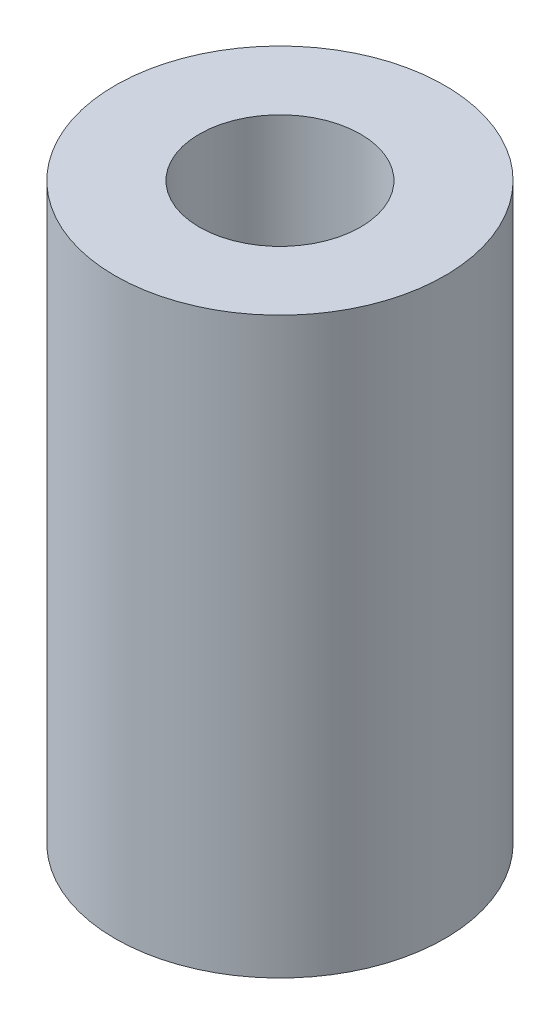
ISO-10303-21;
HEADER;
FILE_DESCRIPTION(('STEP AP214'),'2;1');
FILE_NAME('part.step','',(''),(''),'','','');
FILE_SCHEMA(('AUTOMOTIVE_DESIGN { 1 0 10303 214 1 1 1 1 }'));
ENDSEC;
DATA;
#1=APPLICATION_CONTEXT('core data for automotive mechanical design processes');
#2=APPLICATION_PROTOCOL_DEFINITION('international standard','automotive_design',2000,#1);
#3=PRODUCT_CONTEXT('',#1,'mechanical');
#4=PRODUCT('Part','Part','',(#3));
#5=PRODUCT_RELATED_PRODUCT_CATEGORY('part','',(#4));
#6=PRODUCT_DEFINITION_FORMATION('','',#4);
#7=PRODUCT_DEFINITION_CONTEXT('part definition',#1,'design');
#8=PRODUCT_DEFINITION('design','',#6,#7);
#9=PRODUCT_DEFINITION_SHAPE('','',#8);
#10=(LENGTH_UNIT() NAMED_UNIT(*) SI_UNIT(.MILLI.,.METRE.));
#11=(NAMED_UNIT(*) PLANE_ANGLE_UNIT() SI_UNIT($,.RADIAN.));
#12=(NAMED_UNIT(*) SI_UNIT($,.STERADIAN.) SOLID_ANGLE_UNIT());
#13=UNCERTAINTY_MEASURE_WITH_UNIT(LENGTH_MEASURE(1.E-05),#10,'distance_accuracy_value','');
#14=(GEOMETRIC_REPRESENTATION_CONTEXT(3) GLOBAL_UNCERTAINTY_ASSIGNED_CONTEXT((#13)) GLOBAL_UNIT_ASSIGNED_CONTEXT((#10,
#11,#12)) REPRESENTATION_CONTEXT('',''));
#15=CARTESIAN_POINT('',(0.,0.,0.));
#16=DIRECTION('',(0.,0.,1.));
#17=DIRECTION('',(1.,0.,0.));
#18=AXIS2_PLACEMENT_3D('',#15,#16,#17);
#19=CARTESIAN_POINT('',(0.,113.03,0.));
#20=DIRECTION('',(0.,1.,0.));
#21=DIRECTION('',(0.,0.,1.));
#22=AXIS2_PLACEMENT_3D('',#19,#20,#21);
#23=PLANE('',#22);
#24=CARTESIAN_POINT('',(0.,113.03,0.));
#25=DIRECTION('',(0.,1.,0.));
#26=DIRECTION('',(0.,0.,1.));
#27=AXIS2_PLACEMENT_3D('',#24,#25,#26);
#28=CIRCLE('',#27,32.4612);
#29=CARTESIAN_POINT('',(0.,113.03,32.4612));
#30=VERTEX_POINT('',#29);
#31=EDGE_CURVE('E10',#30,#30,#28,.T.);
#32=ORIENTED_EDGE('',*,*,#31,.T.);
#33=EDGE_LOOP('',(#32));
#34=FACE_BOUND('',#33,.T.);
#35=CARTESIAN_POINT('',(0.,113.03,0.));
#36=DIRECTION('',(0.,1.,0.));
#37=DIRECTION('',(0.,0.,1.));
#38=AXIS2_PLACEMENT_3D('',#35,#36,#37);
#39=CIRCLE('',#38,15.875);
#40=CARTESIAN_POINT('',(0.,113.03,15.875));
#41=VERTEX_POINT('',#40);
#42=EDGE_CURVE('E45',#41,#41,#39,.T.);
#43=ORIENTED_EDGE('',*,*,#42,.F.);
#44=EDGE_LOOP('',(#43));
#45=FACE_BOUND('',#44,.T.);
#46=ADVANCED_FACE('F34',(#34,#45),#23,.T.);
#47=CARTESIAN_POINT('',(0.,0.,0.));
#48=DIRECTION('',(0.,1.,0.));
#49=DIRECTION('',(0.,0.,1.));
#50=AXIS2_PLACEMENT_3D('',#47,#48,#49);
#51=PLANE('',#50);
#52=CARTESIAN_POINT('',(0.,0.,0.));
#53=DIRECTION('',(0.,1.,0.));
#54=DIRECTION('',(0.,0.,1.));
#55=AXIS2_PLACEMENT_3D('',#52,#53,#54);
#56=CIRCLE('',#55,32.4612);
#57=CARTESIAN_POINT('',(0.,0.,32.4612));
#58=VERTEX_POINT('',#57);
#59=EDGE_CURVE('E38',#58,#58,#56,.T.);
#60=ORIENTED_EDGE('',*,*,#59,.F.);
#61=EDGE_LOOP('',(#60));
#62=FACE_BOUND('',#61,.T.);
#63=CARTESIAN_POINT('',(0.,0.,0.));
#64=DIRECTION('',(0.,1.,0.));
#65=DIRECTION('',(0.,0.,1.));
#66=AXIS2_PLACEMENT_3D('',#63,#64,#65);
#67=CIRCLE('',#66,15.875);
#68=CARTESIAN_POINT('',(0.,0.,15.875));
#69=VERTEX_POINT('',#68);
#70=EDGE_CURVE('E47',#69,#69,#67,.T.);
#71=ORIENTED_EDGE('',*,*,#70,.T.);
#72=EDGE_LOOP('',(#71));
#73=FACE_BOUND('',#72,.T.);
#74=ADVANCED_FACE('F57',(#62,#73),#51,.F.);
#75=CARTESIAN_POINT('',(0.,113.03,0.));
#76=DIRECTION('',(0.,-1.,0.));
#77=DIRECTION('',(0.,0.,-1.));
#78=AXIS2_PLACEMENT_3D('',#75,#76,#77);
#79=CYLINDRICAL_SURFACE('',#78,32.4612);
#80=ORIENTED_EDGE('',*,*,#31,.F.);
#81=EDGE_LOOP('',(#80));
#82=FACE_BOUND('',#81,.T.);
#83=ORIENTED_EDGE('',*,*,#59,.T.);
#84=EDGE_LOOP('',(#83));
#85=FACE_BOUND('',#84,.T.);
#86=ADVANCED_FACE('F36',(#82,#85),#79,.T.);
#87=CARTESIAN_POINT('',(0.,113.03,0.));
#88=DIRECTION('',(0.,-1.,0.));
#89=DIRECTION('',(0.,0.,-1.));
#90=AXIS2_PLACEMENT_3D('',#87,#88,#89);
#91=CYLINDRICAL_SURFACE('',#90,15.875);
#92=ORIENTED_EDGE('',*,*,#42,.T.);
#93=EDGE_LOOP('',(#92));
#94=FACE_BOUND('',#93,.T.);
#95=ORIENTED_EDGE('',*,*,#70,.F.);
#96=EDGE_LOOP('',(#95));
#97=FACE_BOUND('',#96,.T.);
#98=ADVANCED_FACE('F53',(#94,#97),#91,.F.);
#99=CLOSED_SHELL('',(#46,#74,#86,#98));
#100=MANIFOLD_SOLID_BREP('B2',#99);
#101=ADVANCED_BREP_SHAPE_REPRESENTATION('',(#18,#100),#14);
#102=SHAPE_DEFINITION_REPRESENTATION(#9,#101);
ENDSEC;
END-ISO-10303-21;
